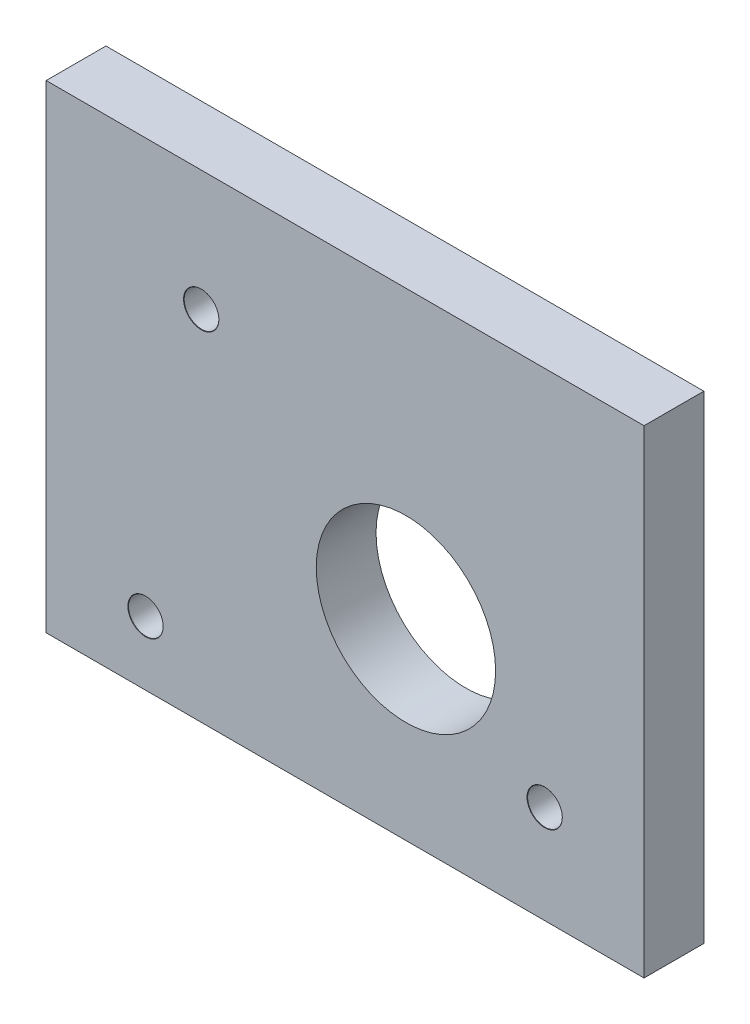
ISO-10303-21;
HEADER;
FILE_DESCRIPTION(('STEP AP214'),'2;1');
FILE_NAME('part.step','',(''),(''),'','','');
FILE_SCHEMA(('AUTOMOTIVE_DESIGN { 1 0 10303 214 1 1 1 1 }'));
ENDSEC;
DATA;
#1=APPLICATION_CONTEXT('core data for automotive mechanical design processes');
#2=APPLICATION_PROTOCOL_DEFINITION('international standard','automotive_design',2000,#1);
#3=PRODUCT_CONTEXT('',#1,'mechanical');
#4=PRODUCT('Part','Part','',(#3));
#5=PRODUCT_RELATED_PRODUCT_CATEGORY('part','',(#4));
#6=PRODUCT_DEFINITION_FORMATION('','',#4);
#7=PRODUCT_DEFINITION_CONTEXT('part definition',#1,'design');
#8=PRODUCT_DEFINITION('design','',#6,#7);
#9=PRODUCT_DEFINITION_SHAPE('','',#8);
#10=(LENGTH_UNIT() NAMED_UNIT(*) SI_UNIT(.MILLI.,.METRE.));
#11=(NAMED_UNIT(*) PLANE_ANGLE_UNIT() SI_UNIT($,.RADIAN.));
#12=(NAMED_UNIT(*) SI_UNIT($,.STERADIAN.) SOLID_ANGLE_UNIT());
#13=UNCERTAINTY_MEASURE_WITH_UNIT(LENGTH_MEASURE(1.E-05),#10,'distance_accuracy_value','');
#14=(GEOMETRIC_REPRESENTATION_CONTEXT(3) GLOBAL_UNCERTAINTY_ASSIGNED_CONTEXT((#13)) GLOBAL_UNIT_ASSIGNED_CONTEXT((#10,
#11,#12)) REPRESENTATION_CONTEXT('',''));
#15=CARTESIAN_POINT('',(0.,0.,0.));
#16=DIRECTION('',(0.,0.,1.));
#17=DIRECTION('',(1.,0.,0.));
#18=AXIS2_PLACEMENT_3D('',#15,#16,#17);
#19=CARTESIAN_POINT('',(-8.31115342511653,34.6543918133686,2.5));
#20=DIRECTION('',(1.,0.,0.));
#21=DIRECTION('',(0.,1.,0.));
#22=AXIS2_PLACEMENT_3D('',#19,#20,#21);
#23=PLANE('',#22);
#24=DIRECTION('',(0.,-1.,0.));
#25=VECTOR('',#24,1.);
#26=CARTESIAN_POINT('',(-8.31115342511653,34.6543918133686,-2.5));
#27=LINE('',#26,#25);
#28=CARTESIAN_POINT('',(-8.31115342511653,34.6543918133686,-2.5));
#29=VERTEX_POINT('',#28);
#30=CARTESIAN_POINT('',(-8.31115342511652,-5.34560818663142,-2.5));
#31=VERTEX_POINT('',#30);
#32=EDGE_CURVE('E101',#29,#31,#27,.T.);
#33=ORIENTED_EDGE('',*,*,#32,.T.);
#34=DIRECTION('',(0.,0.,-1.));
#35=VECTOR('',#34,1.);
#36=CARTESIAN_POINT('',(-8.31115342511652,-5.34560818663142,2.5));
#37=LINE('',#36,#35);
#38=CARTESIAN_POINT('',(-8.31115342511652,-5.34560818663142,2.5));
#39=VERTEX_POINT('',#38);
#40=EDGE_CURVE('E11',#39,#31,#37,.T.);
#41=ORIENTED_EDGE('',*,*,#40,.F.);
#42=DIRECTION('',(0.,-1.,0.));
#43=VECTOR('',#42,1.);
#44=CARTESIAN_POINT('',(-8.31115342511653,34.6543918133686,2.5));
#45=LINE('',#44,#43);
#46=CARTESIAN_POINT('',(-8.31115342511653,34.6543918133686,2.5));
#47=VERTEX_POINT('',#46);
#48=EDGE_CURVE('E87',#47,#39,#45,.T.);
#49=ORIENTED_EDGE('',*,*,#48,.F.);
#50=DIRECTION('',(0.,0.,-1.));
#51=VECTOR('',#50,1.);
#52=CARTESIAN_POINT('',(-8.31115342511653,34.6543918133686,2.5));
#53=LINE('',#52,#51);
#54=EDGE_CURVE('E54',#47,#29,#53,.T.);
#55=ORIENTED_EDGE('',*,*,#54,.T.);
#56=EDGE_LOOP('',(#33,#41,#49,#55));
#57=FACE_BOUND('',#56,.T.);
#58=ADVANCED_FACE('F38',(#57),#23,.F.);
#59=CARTESIAN_POINT('',(-8.31115342511652,-5.34560818663142,2.5));
#60=DIRECTION('',(0.,1.,0.));
#61=DIRECTION('',(-1.,0.,0.));
#62=AXIS2_PLACEMENT_3D('',#59,#60,#61);
#63=PLANE('',#62);
#64=DIRECTION('',(1.,0.,0.));
#65=VECTOR('',#64,1.);
#66=CARTESIAN_POINT('',(-8.31115342511652,-5.34560818663142,-2.5));
#67=LINE('',#66,#65);
#68=CARTESIAN_POINT('',(41.6888465748835,-5.34560818663142,-2.5));
#69=VERTEX_POINT('',#68);
#70=EDGE_CURVE('E92',#31,#69,#67,.T.);
#71=ORIENTED_EDGE('',*,*,#70,.T.);
#72=DIRECTION('',(0.,0.,-1.));
#73=VECTOR('',#72,1.);
#74=CARTESIAN_POINT('',(41.6888465748835,-5.34560818663142,2.5));
#75=LINE('',#74,#73);
#76=CARTESIAN_POINT('',(41.6888465748835,-5.34560818663142,2.5));
#77=VERTEX_POINT('',#76);
#78=EDGE_CURVE('E46',#77,#69,#75,.T.);
#79=ORIENTED_EDGE('',*,*,#78,.F.);
#80=DIRECTION('',(1.,0.,0.));
#81=VECTOR('',#80,1.);
#82=CARTESIAN_POINT('',(-8.31115342511652,-5.34560818663142,2.5));
#83=LINE('',#82,#81);
#84=EDGE_CURVE('E79',#39,#77,#83,.T.);
#85=ORIENTED_EDGE('',*,*,#84,.F.);
#86=ORIENTED_EDGE('',*,*,#40,.T.);
#87=EDGE_LOOP('',(#71,#79,#85,#86));
#88=FACE_BOUND('',#87,.T.);
#89=ADVANCED_FACE('F91',(#88),#63,.F.);
#90=CARTESIAN_POINT('',(41.6888465748835,34.6543918133686,2.5));
#91=DIRECTION('',(1.,0.,0.));
#92=DIRECTION('',(0.,1.,0.));
#93=AXIS2_PLACEMENT_3D('',#90,#91,#92);
#94=PLANE('',#93);
#95=DIRECTION('',(0.,-1.,0.));
#96=VECTOR('',#95,1.);
#97=CARTESIAN_POINT('',(41.6888465748835,34.6543918133686,-2.5));
#98=LINE('',#97,#96);
#99=CARTESIAN_POINT('',(41.6888465748835,34.6543918133686,-2.5));
#100=VERTEX_POINT('',#99);
#101=EDGE_CURVE('E105',#100,#69,#98,.T.);
#102=ORIENTED_EDGE('',*,*,#101,.F.);
#103=DIRECTION('',(0.,0.,-1.));
#104=VECTOR('',#103,1.);
#105=CARTESIAN_POINT('',(41.6888465748835,34.6543918133686,2.5));
#106=LINE('',#105,#104);
#107=CARTESIAN_POINT('',(41.6888465748835,34.6543918133686,2.5));
#108=VERTEX_POINT('',#107);
#109=EDGE_CURVE('E68',#108,#100,#106,.T.);
#110=ORIENTED_EDGE('',*,*,#109,.F.);
#111=DIRECTION('',(0.,-1.,0.));
#112=VECTOR('',#111,1.);
#113=CARTESIAN_POINT('',(41.6888465748835,34.6543918133686,2.5));
#114=LINE('',#113,#112);
#115=EDGE_CURVE('E86',#108,#77,#114,.T.);
#116=ORIENTED_EDGE('',*,*,#115,.T.);
#117=ORIENTED_EDGE('',*,*,#78,.T.);
#118=EDGE_LOOP('',(#102,#110,#116,#117));
#119=FACE_BOUND('',#118,.T.);
#120=ADVANCED_FACE('F95',(#119),#94,.T.);
#121=CARTESIAN_POINT('',(-8.31115342511653,34.6543918133686,2.5));
#122=DIRECTION('',(0.,1.,0.));
#123=DIRECTION('',(-1.,0.,0.));
#124=AXIS2_PLACEMENT_3D('',#121,#122,#123);
#125=PLANE('',#124);
#126=DIRECTION('',(1.,0.,0.));
#127=VECTOR('',#126,1.);
#128=CARTESIAN_POINT('',(-8.31115342511653,34.6543918133686,-2.5));
#129=LINE('',#128,#127);
#130=EDGE_CURVE('E107',#29,#100,#129,.T.);
#131=ORIENTED_EDGE('',*,*,#130,.F.);
#132=ORIENTED_EDGE('',*,*,#54,.F.);
#133=DIRECTION('',(1.,0.,0.));
#134=VECTOR('',#133,1.);
#135=CARTESIAN_POINT('',(-8.31115342511653,34.6543918133686,2.5));
#136=LINE('',#135,#134);
#137=EDGE_CURVE('E96',#47,#108,#136,.T.);
#138=ORIENTED_EDGE('',*,*,#137,.T.);
#139=ORIENTED_EDGE('',*,*,#109,.T.);
#140=EDGE_LOOP('',(#131,#132,#138,#139));
#141=FACE_BOUND('',#140,.T.);
#142=ADVANCED_FACE('F158',(#141),#125,.T.);
#143=CARTESIAN_POINT('',(0.,0.,2.5));
#144=DIRECTION('',(0.,0.,1.));
#145=DIRECTION('',(1.,0.,0.));
#146=AXIS2_PLACEMENT_3D('',#143,#144,#145);
#147=PLANE('',#146);
#148=CARTESIAN_POINT('',(21.7753616969501,10.6949157531511,2.5));
#149=DIRECTION('',(0.,0.,1.));
#150=DIRECTION('',(1.,0.,0.));
#151=AXIS2_PLACEMENT_3D('',#148,#149,#150);
#152=CIRCLE('',#151,7.5);
#153=CARTESIAN_POINT('',(29.2753616969501,10.6949157531511,2.5));
#154=VERTEX_POINT('',#153);
#155=EDGE_CURVE('E140',#154,#154,#152,.T.);
#156=ORIENTED_EDGE('',*,*,#155,.F.);
#157=EDGE_LOOP('',(#156));
#158=FACE_BOUND('',#157,.T.);
#159=CARTESIAN_POINT('',(4.65506822509844,24.5627836333686,2.5));
#160=DIRECTION('',(0.,0.,1.));
#161=DIRECTION('',(1.,0.,0.));
#162=AXIS2_PLACEMENT_3D('',#159,#160,#161);
#163=CIRCLE('',#162,1.475);
#164=CARTESIAN_POINT('',(6.13006822509844,24.5627836333686,2.5));
#165=VERTEX_POINT('',#164);
#166=EDGE_CURVE('E136',#165,#165,#163,.T.);
#167=ORIENTED_EDGE('',*,*,#166,.F.);
#168=EDGE_LOOP('',(#167));
#169=FACE_BOUND('',#168,.T.);
#170=CARTESIAN_POINT('',(33.377693149767,2.86,2.5));
#171=DIRECTION('',(0.,0.,1.));
#172=DIRECTION('',(1.,0.,0.));
#173=AXIS2_PLACEMENT_3D('',#170,#171,#172);
#174=CIRCLE('',#173,1.475);
#175=CARTESIAN_POINT('',(34.8526931497669,2.86,2.5));
#176=VERTEX_POINT('',#175);
#177=EDGE_CURVE('E127',#176,#176,#174,.T.);
#178=ORIENTED_EDGE('',*,*,#177,.F.);
#179=EDGE_LOOP('',(#178));
#180=FACE_BOUND('',#179,.T.);
#181=CARTESIAN_POINT('',(0.,0.,2.5));
#182=DIRECTION('',(0.,0.,1.));
#183=DIRECTION('',(1.,0.,0.));
#184=AXIS2_PLACEMENT_3D('',#181,#182,#183);
#185=CIRCLE('',#184,1.475);
#186=CARTESIAN_POINT('',(1.475,0.,2.5));
#187=VERTEX_POINT('',#186);
#188=EDGE_CURVE('E118',#187,#187,#185,.T.);
#189=ORIENTED_EDGE('',*,*,#188,.F.);
#190=EDGE_LOOP('',(#189));
#191=FACE_BOUND('',#190,.T.);
#192=ORIENTED_EDGE('',*,*,#48,.T.);
#193=ORIENTED_EDGE('',*,*,#84,.T.);
#194=ORIENTED_EDGE('',*,*,#115,.F.);
#195=ORIENTED_EDGE('',*,*,#137,.F.);
#196=EDGE_LOOP('',(#192,#193,#194,#195));
#197=FACE_BOUND('',#196,.T.);
#198=ADVANCED_FACE('F83',(#158,#169,#180,#191,#197),#147,.T.);
#199=CARTESIAN_POINT('',(0.,0.,-2.5));
#200=DIRECTION('',(0.,0.,1.));
#201=DIRECTION('',(1.,0.,0.));
#202=AXIS2_PLACEMENT_3D('',#199,#200,#201);
#203=PLANE('',#202);
#204=CARTESIAN_POINT('',(21.7753616969501,10.6949157531511,-2.5));
#205=DIRECTION('',(0.,0.,1.));
#206=DIRECTION('',(1.,0.,0.));
#207=AXIS2_PLACEMENT_3D('',#204,#205,#206);
#208=CIRCLE('',#207,7.5);
#209=CARTESIAN_POINT('',(29.2753616969501,10.6949157531511,-2.5));
#210=VERTEX_POINT('',#209);
#211=EDGE_CURVE('E139',#210,#210,#208,.T.);
#212=ORIENTED_EDGE('',*,*,#211,.T.);
#213=EDGE_LOOP('',(#212));
#214=FACE_BOUND('',#213,.T.);
#215=CARTESIAN_POINT('',(4.65506822509844,24.5627836333686,-2.5));
#216=DIRECTION('',(0.,0.,1.));
#217=DIRECTION('',(1.,0.,0.));
#218=AXIS2_PLACEMENT_3D('',#215,#216,#217);
#219=CIRCLE('',#218,1.45);
#220=CARTESIAN_POINT('',(6.10506822509844,24.5627836333686,-2.5));
#221=VERTEX_POINT('',#220);
#222=EDGE_CURVE('E130',#221,#221,#219,.T.);
#223=ORIENTED_EDGE('',*,*,#222,.T.);
#224=EDGE_LOOP('',(#223));
#225=FACE_BOUND('',#224,.T.);
#226=CARTESIAN_POINT('',(33.377693149767,2.86,-2.5));
#227=DIRECTION('',(0.,0.,1.));
#228=DIRECTION('',(1.,0.,0.));
#229=AXIS2_PLACEMENT_3D('',#226,#227,#228);
#230=CIRCLE('',#229,1.45);
#231=CARTESIAN_POINT('',(34.827693149767,2.86,-2.5));
#232=VERTEX_POINT('',#231);
#233=EDGE_CURVE('E121',#232,#232,#230,.T.);
#234=ORIENTED_EDGE('',*,*,#233,.T.);
#235=EDGE_LOOP('',(#234));
#236=FACE_BOUND('',#235,.T.);
#237=CARTESIAN_POINT('',(0.,0.,-2.5));
#238=DIRECTION('',(0.,0.,1.));
#239=DIRECTION('',(1.,0.,0.));
#240=AXIS2_PLACEMENT_3D('',#237,#238,#239);
#241=CIRCLE('',#240,1.45);
#242=CARTESIAN_POINT('',(1.45,0.,-2.5));
#243=VERTEX_POINT('',#242);
#244=EDGE_CURVE('E103',#243,#243,#241,.T.);
#245=ORIENTED_EDGE('',*,*,#244,.T.);
#246=EDGE_LOOP('',(#245));
#247=FACE_BOUND('',#246,.T.);
#248=ORIENTED_EDGE('',*,*,#32,.F.);
#249=ORIENTED_EDGE('',*,*,#130,.T.);
#250=ORIENTED_EDGE('',*,*,#101,.T.);
#251=ORIENTED_EDGE('',*,*,#70,.F.);
#252=EDGE_LOOP('',(#248,#249,#250,#251));
#253=FACE_BOUND('',#252,.T.);
#254=ADVANCED_FACE('F146',(#214,#225,#236,#247,#253),#203,.F.);
#255=CARTESIAN_POINT('',(0.,0.,2.5));
#256=DIRECTION('',(0.,0.,1.));
#257=DIRECTION('',(1.,0.,0.));
#258=AXIS2_PLACEMENT_3D('',#255,#256,#257);
#259=CYLINDRICAL_SURFACE('',#258,1.45);
#260=ORIENTED_EDGE('',*,*,#244,.F.);
#261=EDGE_LOOP('',(#260));
#262=FACE_BOUND('',#261,.T.);
#263=CARTESIAN_POINT('',(0.,0.,2.475));
#264=DIRECTION('',(0.,0.,1.));
#265=DIRECTION('',(1.,0.,0.));
#266=AXIS2_PLACEMENT_3D('',#263,#264,#265);
#267=CIRCLE('',#266,1.45);
#268=CARTESIAN_POINT('',(1.45,0.,2.475));
#269=VERTEX_POINT('',#268);
#270=EDGE_CURVE('E115',#269,#269,#267,.T.);
#271=ORIENTED_EDGE('',*,*,#270,.T.);
#272=EDGE_LOOP('',(#271));
#273=FACE_BOUND('',#272,.T.);
#274=ADVANCED_FACE('F169',(#262,#273),#259,.F.);
#275=CARTESIAN_POINT('',(0.,0.,2.5));
#276=DIRECTION('',(0.,0.,1.));
#277=DIRECTION('',(1.,0.,0.));
#278=AXIS2_PLACEMENT_3D('',#275,#276,#277);
#279=CONICAL_SURFACE('',#278,1.475,0.78539816339747);
#280=ORIENTED_EDGE('',*,*,#270,.F.);
#281=EDGE_LOOP('',(#280));
#282=FACE_BOUND('',#281,.T.);
#283=ORIENTED_EDGE('',*,*,#188,.T.);
#284=EDGE_LOOP('',(#283));
#285=FACE_BOUND('',#284,.T.);
#286=ADVANCED_FACE('F166',(#282,#285),#279,.F.);
#287=CARTESIAN_POINT('',(33.377693149767,2.86,2.5));
#288=DIRECTION('',(0.,0.,1.));
#289=DIRECTION('',(1.,0.,0.));
#290=AXIS2_PLACEMENT_3D('',#287,#288,#289);
#291=CYLINDRICAL_SURFACE('',#290,1.45);
#292=ORIENTED_EDGE('',*,*,#233,.F.);
#293=EDGE_LOOP('',(#292));
#294=FACE_BOUND('',#293,.T.);
#295=CARTESIAN_POINT('',(33.377693149767,2.86,2.475));
#296=DIRECTION('',(0.,0.,1.));
#297=DIRECTION('',(1.,0.,0.));
#298=AXIS2_PLACEMENT_3D('',#295,#296,#297);
#299=CIRCLE('',#298,1.45);
#300=CARTESIAN_POINT('',(34.827693149767,2.86,2.475));
#301=VERTEX_POINT('',#300);
#302=EDGE_CURVE('E124',#301,#301,#299,.T.);
#303=ORIENTED_EDGE('',*,*,#302,.T.);
#304=EDGE_LOOP('',(#303));
#305=FACE_BOUND('',#304,.T.);
#306=ADVANCED_FACE('F168',(#294,#305),#291,.F.);
#307=CARTESIAN_POINT('',(33.377693149767,2.86,2.5));
#308=DIRECTION('',(0.,0.,1.));
#309=DIRECTION('',(1.,0.,0.));
#310=AXIS2_PLACEMENT_3D('',#307,#308,#309);
#311=CONICAL_SURFACE('',#310,1.475,0.785398163397396);
#312=ORIENTED_EDGE('',*,*,#302,.F.);
#313=EDGE_LOOP('',(#312));
#314=FACE_BOUND('',#313,.T.);
#315=ORIENTED_EDGE('',*,*,#177,.T.);
#316=EDGE_LOOP('',(#315));
#317=FACE_BOUND('',#316,.T.);
#318=ADVANCED_FACE('F176',(#314,#317),#311,.F.);
#319=CARTESIAN_POINT('',(4.65506822509844,24.5627836333686,2.5));
#320=DIRECTION('',(0.,0.,1.));
#321=DIRECTION('',(1.,0.,0.));
#322=AXIS2_PLACEMENT_3D('',#319,#320,#321);
#323=CYLINDRICAL_SURFACE('',#322,1.45);
#324=ORIENTED_EDGE('',*,*,#222,.F.);
#325=EDGE_LOOP('',(#324));
#326=FACE_BOUND('',#325,.T.);
#327=CARTESIAN_POINT('',(4.65506822509844,24.5627836333686,2.475));
#328=DIRECTION('',(0.,0.,1.));
#329=DIRECTION('',(1.,0.,0.));
#330=AXIS2_PLACEMENT_3D('',#327,#328,#329);
#331=CIRCLE('',#330,1.45);
#332=CARTESIAN_POINT('',(6.10506822509844,24.5627836333686,2.475));
#333=VERTEX_POINT('',#332);
#334=EDGE_CURVE('E133',#333,#333,#331,.T.);
#335=ORIENTED_EDGE('',*,*,#334,.T.);
#336=EDGE_LOOP('',(#335));
#337=FACE_BOUND('',#336,.T.);
#338=ADVANCED_FACE('F214',(#326,#337),#323,.F.);
#339=CARTESIAN_POINT('',(4.65506822509844,24.5627836333686,2.5));
#340=DIRECTION('',(0.,0.,1.));
#341=DIRECTION('',(1.,0.,0.));
#342=AXIS2_PLACEMENT_3D('',#339,#340,#341);
#343=CONICAL_SURFACE('',#342,1.475,0.785398163397483);
#344=ORIENTED_EDGE('',*,*,#334,.F.);
#345=EDGE_LOOP('',(#344));
#346=FACE_BOUND('',#345,.T.);
#347=ORIENTED_EDGE('',*,*,#166,.T.);
#348=EDGE_LOOP('',(#347));
#349=FACE_BOUND('',#348,.T.);
#350=ADVANCED_FACE('F152',(#346,#349),#343,.F.);
#351=CARTESIAN_POINT('',(21.7753616969501,10.6949157531511,-2.5));
#352=DIRECTION('',(0.,0.,1.));
#353=DIRECTION('',(1.,0.,0.));
#354=AXIS2_PLACEMENT_3D('',#351,#352,#353);
#355=CYLINDRICAL_SURFACE('',#354,7.5);
#356=ORIENTED_EDGE('',*,*,#211,.F.);
#357=EDGE_LOOP('',(#356));
#358=FACE_BOUND('',#357,.T.);
#359=ORIENTED_EDGE('',*,*,#155,.T.);
#360=EDGE_LOOP('',(#359));
#361=FACE_BOUND('',#360,.T.);
#362=ADVANCED_FACE('F149',(#358,#361),#355,.F.);
#363=CLOSED_SHELL('',(#58,#89,#120,#142,#198,#254,#274,#286,#306,#318,#338,#350,#362));
#364=MANIFOLD_SOLID_BREP('B2',#363);
#365=ADVANCED_BREP_SHAPE_REPRESENTATION('',(#18,#364),#14);
#366=SHAPE_DEFINITION_REPRESENTATION(#9,#365);
ENDSEC;
END-ISO-10303-21;
